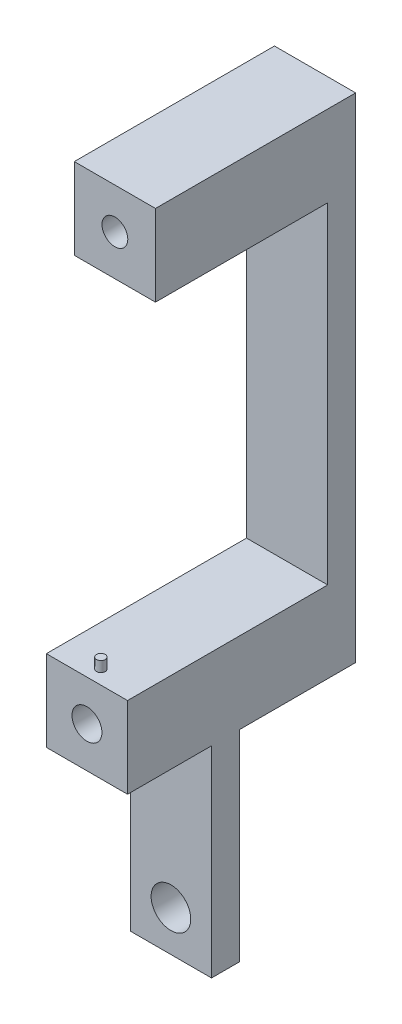
ISO-10303-21;
HEADER;
FILE_DESCRIPTION(('STEP AP214'),'2;1');
FILE_NAME('part.step','',(''),(''),'','','');
FILE_SCHEMA(('AUTOMOTIVE_DESIGN { 1 0 10303 214 1 1 1 1 }'));
ENDSEC;
DATA;
#1=APPLICATION_CONTEXT('core data for automotive mechanical design processes');
#2=APPLICATION_PROTOCOL_DEFINITION('international standard','automotive_design',2000,#1);
#3=PRODUCT_CONTEXT('',#1,'mechanical');
#4=PRODUCT('Part','Part','',(#3));
#5=PRODUCT_RELATED_PRODUCT_CATEGORY('part','',(#4));
#6=PRODUCT_DEFINITION_FORMATION('','',#4);
#7=PRODUCT_DEFINITION_CONTEXT('part definition',#1,'design');
#8=PRODUCT_DEFINITION('design','',#6,#7);
#9=PRODUCT_DEFINITION_SHAPE('','',#8);
#10=(LENGTH_UNIT() NAMED_UNIT(*) SI_UNIT(.MILLI.,.METRE.));
#11=(NAMED_UNIT(*) PLANE_ANGLE_UNIT() SI_UNIT($,.RADIAN.));
#12=(NAMED_UNIT(*) SI_UNIT($,.STERADIAN.) SOLID_ANGLE_UNIT());
#13=UNCERTAINTY_MEASURE_WITH_UNIT(LENGTH_MEASURE(1.E-05),#10,'distance_accuracy_value','');
#14=(GEOMETRIC_REPRESENTATION_CONTEXT(3) GLOBAL_UNCERTAINTY_ASSIGNED_CONTEXT((#13)) GLOBAL_UNIT_ASSIGNED_CONTEXT((#10,
#11,#12)) REPRESENTATION_CONTEXT('',''));
#15=CARTESIAN_POINT('',(0.,0.,0.));
#16=DIRECTION('',(0.,0.,1.));
#17=DIRECTION('',(1.,0.,0.));
#18=AXIS2_PLACEMENT_3D('',#15,#16,#17);
#19=CARTESIAN_POINT('',(13.843,118.4148,-15.0495));
#20=DIRECTION('',(0.,0.,-1.));
#21=DIRECTION('',(-1.,0.,0.));
#22=AXIS2_PLACEMENT_3D('',#19,#20,#21);
#23=PLANE('',#22);
#24=DIRECTION('',(1.,0.,0.));
#25=VECTOR('',#24,1.);
#26=CARTESIAN_POINT('',(0.,104.5718,-15.0495));
#27=LINE('',#26,#25);
#28=CARTESIAN_POINT('',(0.,104.5718,-15.0495));
#29=VERTEX_POINT('',#28);
#30=CARTESIAN_POINT('',(13.843,104.5718,-15.0495));
#31=VERTEX_POINT('',#30);
#32=EDGE_CURVE('E154',#29,#31,#27,.T.);
#33=ORIENTED_EDGE('',*,*,#32,.F.);
#34=DIRECTION('',(0.,-1.,0.));
#35=VECTOR('',#34,1.);
#36=CARTESIAN_POINT('',(0.,118.4148,-15.0495));
#37=LINE('',#36,#35);
#38=CARTESIAN_POINT('',(0.,48.133,-15.0495));
#39=VERTEX_POINT('',#38);
#40=EDGE_CURVE('E56',#29,#39,#37,.T.);
#41=ORIENTED_EDGE('',*,*,#40,.T.);
#42=DIRECTION('',(1.,0.,0.));
#43=VECTOR('',#42,1.);
#44=CARTESIAN_POINT('',(13.843,48.133,-15.0495));
#45=LINE('',#44,#43);
#46=CARTESIAN_POINT('',(13.843,48.133,-15.0495));
#47=VERTEX_POINT('',#46);
#48=EDGE_CURVE('E158',#39,#47,#45,.T.);
#49=ORIENTED_EDGE('',*,*,#48,.T.);
#50=DIRECTION('',(0.,-1.,0.));
#51=VECTOR('',#50,1.);
#52=CARTESIAN_POINT('',(13.843,118.4148,-15.0495));
#53=LINE('',#52,#51);
#54=EDGE_CURVE('E176',#31,#47,#53,.T.);
#55=ORIENTED_EDGE('',*,*,#54,.F.);
#56=EDGE_LOOP('',(#33,#41,#49,#55));
#57=FACE_BOUND('',#56,.T.);
#58=ADVANCED_FACE('F40',(#57),#23,.F.);
#59=CARTESIAN_POINT('',(0.,48.133,4.7625));
#60=DIRECTION('',(0.,-1.,0.));
#61=DIRECTION('',(0.,0.,-1.));
#62=AXIS2_PLACEMENT_3D('',#59,#60,#61);
#63=PLANE('',#62);
#64=CARTESIAN_POINT('',(6.9215,48.133,16.7005));
#65=DIRECTION('',(0.,-1.,0.));
#66=DIRECTION('',(0.,0.,-1.));
#67=AXIS2_PLACEMENT_3D('',#64,#65,#66);
#68=CIRCLE('',#67,0.7493);
#69=CARTESIAN_POINT('',(6.9215,48.133,15.9512));
#70=VERTEX_POINT('',#69);
#71=EDGE_CURVE('E12',#70,#70,#68,.F.);
#72=ORIENTED_EDGE('',*,*,#71,.F.);
#73=EDGE_LOOP('',(#72));
#74=FACE_BOUND('',#73,.T.);
#75=ORIENTED_EDGE('',*,*,#48,.F.);
#76=DIRECTION('',(0.,0.,-1.));
#77=VECTOR('',#76,1.);
#78=CARTESIAN_POINT('',(0.,48.133,4.7625));
#79=LINE('',#78,#77);
#80=CARTESIAN_POINT('',(0.,48.133,19.08175));
#81=VERTEX_POINT('',#80);
#82=EDGE_CURVE('E261',#81,#39,#79,.T.);
#83=ORIENTED_EDGE('',*,*,#82,.F.);
#84=DIRECTION('',(-1.,0.,0.));
#85=VECTOR('',#84,1.);
#86=CARTESIAN_POINT('',(0.,48.133,19.08175));
#87=LINE('',#86,#85);
#88=CARTESIAN_POINT('',(13.843,48.133,19.08175));
#89=VERTEX_POINT('',#88);
#90=EDGE_CURVE('E227',#89,#81,#87,.T.);
#91=ORIENTED_EDGE('',*,*,#90,.F.);
#92=DIRECTION('',(0.,0.,-1.));
#93=VECTOR('',#92,1.);
#94=CARTESIAN_POINT('',(13.843,48.133,4.7625));
#95=LINE('',#94,#93);
#96=EDGE_CURVE('E271',#89,#47,#95,.T.);
#97=ORIENTED_EDGE('',*,*,#96,.T.);
#98=EDGE_LOOP('',(#75,#83,#91,#97));
#99=FACE_BOUND('',#98,.T.);
#100=ADVANCED_FACE('F316',(#74,#99),#63,.F.);
#101=CARTESIAN_POINT('',(0.,0.,4.7625));
#102=DIRECTION('',(0.,0.,-1.));
#103=DIRECTION('',(-1.,0.,0.));
#104=AXIS2_PLACEMENT_3D('',#101,#102,#103);
#105=PLANE('',#104);
#106=CARTESIAN_POINT('',(6.9215,6.9215,4.7625));
#107=DIRECTION('',(0.,0.,-1.));
#108=DIRECTION('',(-1.,0.,0.));
#109=AXIS2_PLACEMENT_3D('',#106,#107,#108);
#110=CIRCLE('',#109,3.3782);
#111=CARTESIAN_POINT('',(3.5433,6.9215,4.7625));
#112=VERTEX_POINT('',#111);
#113=EDGE_CURVE('E243',#112,#112,#110,.T.);
#114=ORIENTED_EDGE('',*,*,#113,.T.);
#115=EDGE_LOOP('',(#114));
#116=FACE_BOUND('',#115,.T.);
#117=DIRECTION('',(1.,0.,0.));
#118=VECTOR('',#117,1.);
#119=CARTESIAN_POINT('',(0.,34.29,4.7625));
#120=LINE('',#119,#118);
#121=CARTESIAN_POINT('',(0.,34.29,4.7625));
#122=VERTEX_POINT('',#121);
#123=CARTESIAN_POINT('',(13.843,34.29,4.7625));
#124=VERTEX_POINT('',#123);
#125=EDGE_CURVE('E215',#122,#124,#120,.T.);
#126=ORIENTED_EDGE('',*,*,#125,.F.);
#127=DIRECTION('',(0.,-1.,0.));
#128=VECTOR('',#127,1.);
#129=CARTESIAN_POINT('',(0.,0.,4.7625));
#130=LINE('',#129,#128);
#131=CARTESIAN_POINT('',(0.,0.,4.7625));
#132=VERTEX_POINT('',#131);
#133=EDGE_CURVE('E251',#122,#132,#130,.T.);
#134=ORIENTED_EDGE('',*,*,#133,.T.);
#135=DIRECTION('',(1.,0.,0.));
#136=VECTOR('',#135,1.);
#137=CARTESIAN_POINT('',(0.,0.,4.7625));
#138=LINE('',#137,#136);
#139=CARTESIAN_POINT('',(13.843,0.,4.7625));
#140=VERTEX_POINT('',#139);
#141=EDGE_CURVE('E254',#132,#140,#138,.T.);
#142=ORIENTED_EDGE('',*,*,#141,.T.);
#143=DIRECTION('',(0.,1.,0.));
#144=VECTOR('',#143,1.);
#145=CARTESIAN_POINT('',(13.843,0.,4.7625));
#146=LINE('',#145,#144);
#147=EDGE_CURVE('E258',#140,#124,#146,.T.);
#148=ORIENTED_EDGE('',*,*,#147,.T.);
#149=EDGE_LOOP('',(#126,#134,#142,#148));
#150=FACE_BOUND('',#149,.T.);
#151=ADVANCED_FACE('F329',(#116,#150),#105,.F.);
#152=CARTESIAN_POINT('',(0.,0.,4.7625));
#153=DIRECTION('',(1.,0.,0.));
#154=DIRECTION('',(0.,0.,-1.));
#155=AXIS2_PLACEMENT_3D('',#152,#153,#154);
#156=PLANE('',#155);
#157=ORIENTED_EDGE('',*,*,#82,.T.);
#158=ORIENTED_EDGE('',*,*,#40,.F.);
#159=DIRECTION('',(0.,0.,-1.));
#160=VECTOR('',#159,1.);
#161=CARTESIAN_POINT('',(0.,104.5718,14.31925));
#162=LINE('',#161,#160);
#163=CARTESIAN_POINT('',(0.,104.5718,14.31925));
#164=VERTEX_POINT('',#163);
#165=EDGE_CURVE('E136',#164,#29,#162,.T.);
#166=ORIENTED_EDGE('',*,*,#165,.F.);
#167=DIRECTION('',(0.,-1.,0.));
#168=VECTOR('',#167,1.);
#169=CARTESIAN_POINT('',(0.,118.4148,14.31925));
#170=LINE('',#169,#168);
#171=CARTESIAN_POINT('',(0.,118.4148,14.31925));
#172=VERTEX_POINT('',#171);
#173=EDGE_CURVE('E144',#172,#164,#170,.T.);
#174=ORIENTED_EDGE('',*,*,#173,.F.);
#175=DIRECTION('',(0.,0.,1.));
#176=VECTOR('',#175,1.);
#177=CARTESIAN_POINT('',(0.,118.4148,-19.812));
#178=LINE('',#177,#176);
#179=CARTESIAN_POINT('',(0.,118.4148,-19.812));
#180=VERTEX_POINT('',#179);
#181=EDGE_CURVE('E174',#180,#172,#178,.T.);
#182=ORIENTED_EDGE('',*,*,#181,.F.);
#183=DIRECTION('',(0.,1.,0.));
#184=VECTOR('',#183,1.);
#185=CARTESIAN_POINT('',(0.,48.133,-19.812));
#186=LINE('',#185,#184);
#187=CARTESIAN_POINT('',(0.,34.29,-19.812));
#188=VERTEX_POINT('',#187);
#189=EDGE_CURVE('E202',#188,#180,#186,.T.);
#190=ORIENTED_EDGE('',*,*,#189,.F.);
#191=DIRECTION('',(0.,0.,1.));
#192=VECTOR('',#191,1.);
#193=CARTESIAN_POINT('',(0.,34.29,-19.812));
#194=LINE('',#193,#192);
#195=CARTESIAN_POINT('',(0.,34.29,0.));
#196=VERTEX_POINT('',#195);
#197=EDGE_CURVE('E205',#188,#196,#194,.T.);
#198=ORIENTED_EDGE('',*,*,#197,.T.);
#199=DIRECTION('',(0.,-1.,0.));
#200=VECTOR('',#199,1.);
#201=CARTESIAN_POINT('',(0.,0.,0.));
#202=LINE('',#201,#200);
#203=CARTESIAN_POINT('',(0.,0.,0.));
#204=VERTEX_POINT('',#203);
#205=EDGE_CURVE('E247',#196,#204,#202,.T.);
#206=ORIENTED_EDGE('',*,*,#205,.T.);
#207=DIRECTION('',(0.,0.,-1.));
#208=VECTOR('',#207,1.);
#209=CARTESIAN_POINT('',(0.,0.,4.7625));
#210=LINE('',#209,#208);
#211=EDGE_CURVE('E49',#132,#204,#210,.T.);
#212=ORIENTED_EDGE('',*,*,#211,.F.);
#213=ORIENTED_EDGE('',*,*,#133,.F.);
#214=DIRECTION('',(0.,0.,-1.));
#215=VECTOR('',#214,1.);
#216=CARTESIAN_POINT('',(0.,34.29,19.08175));
#217=LINE('',#216,#215);
#218=CARTESIAN_POINT('',(0.,34.29,19.08175));
#219=VERTEX_POINT('',#218);
#220=EDGE_CURVE('E238',#219,#122,#217,.T.);
#221=ORIENTED_EDGE('',*,*,#220,.F.);
#222=DIRECTION('',(0.,-1.,0.));
#223=VECTOR('',#222,1.);
#224=CARTESIAN_POINT('',(0.,48.133,19.08175));
#225=LINE('',#224,#223);
#226=EDGE_CURVE('E216',#81,#219,#225,.T.);
#227=ORIENTED_EDGE('',*,*,#226,.F.);
#228=EDGE_LOOP('',(#157,#158,#166,#174,#182,#190,#198,#206,#212,#213,#221,#227));
#229=FACE_BOUND('',#228,.T.);
#230=ADVANCED_FACE('F42',(#229),#156,.F.);
#231=CARTESIAN_POINT('',(0.,0.,4.7625));
#232=DIRECTION('',(0.,1.,0.));
#233=DIRECTION('',(0.,0.,1.));
#234=AXIS2_PLACEMENT_3D('',#231,#232,#233);
#235=PLANE('',#234);
#236=DIRECTION('',(1.,0.,0.));
#237=VECTOR('',#236,1.);
#238=CARTESIAN_POINT('',(0.,0.,0.));
#239=LINE('',#238,#237);
#240=CARTESIAN_POINT('',(13.843,0.,0.));
#241=VERTEX_POINT('',#240);
#242=EDGE_CURVE('E264',#204,#241,#239,.T.);
#243=ORIENTED_EDGE('',*,*,#242,.T.);
#244=DIRECTION('',(0.,0.,-1.));
#245=VECTOR('',#244,1.);
#246=CARTESIAN_POINT('',(13.843,0.,4.7625));
#247=LINE('',#246,#245);
#248=EDGE_CURVE('E275',#140,#241,#247,.T.);
#249=ORIENTED_EDGE('',*,*,#248,.F.);
#250=ORIENTED_EDGE('',*,*,#141,.F.);
#251=ORIENTED_EDGE('',*,*,#211,.T.);
#252=EDGE_LOOP('',(#243,#249,#250,#251));
#253=FACE_BOUND('',#252,.T.);
#254=ADVANCED_FACE('F334',(#253),#235,.F.);
#255=CARTESIAN_POINT('',(13.843,0.,4.7625));
#256=DIRECTION('',(-1.,0.,0.));
#257=DIRECTION('',(0.,0.,1.));
#258=AXIS2_PLACEMENT_3D('',#255,#256,#257);
#259=PLANE('',#258);
#260=DIRECTION('',(0.,1.,0.));
#261=VECTOR('',#260,1.);
#262=CARTESIAN_POINT('',(13.843,0.,0.));
#263=LINE('',#262,#261);
#264=CARTESIAN_POINT('',(13.843,34.29,0.));
#265=VERTEX_POINT('',#264);
#266=EDGE_CURVE('E255',#241,#265,#263,.T.);
#267=ORIENTED_EDGE('',*,*,#266,.T.);
#268=DIRECTION('',(0.,0.,1.));
#269=VECTOR('',#268,1.);
#270=CARTESIAN_POINT('',(13.843,34.29,-19.812));
#271=LINE('',#270,#269);
#272=CARTESIAN_POINT('',(13.843,34.29,-19.812));
#273=VERTEX_POINT('',#272);
#274=EDGE_CURVE('E211',#273,#265,#271,.T.);
#275=ORIENTED_EDGE('',*,*,#274,.F.);
#276=DIRECTION('',(0.,-1.,0.));
#277=VECTOR('',#276,1.);
#278=CARTESIAN_POINT('',(13.843,48.133,-19.812));
#279=LINE('',#278,#277);
#280=CARTESIAN_POINT('',(13.843,118.4148,-19.812));
#281=VERTEX_POINT('',#280);
#282=EDGE_CURVE('E195',#281,#273,#279,.T.);
#283=ORIENTED_EDGE('',*,*,#282,.F.);
#284=DIRECTION('',(0.,0.,-1.));
#285=VECTOR('',#284,1.);
#286=CARTESIAN_POINT('',(13.843,118.4148,-19.812));
#287=LINE('',#286,#285);
#288=CARTESIAN_POINT('',(13.843,118.4148,14.31925));
#289=VERTEX_POINT('',#288);
#290=EDGE_CURVE('E162',#289,#281,#287,.T.);
#291=ORIENTED_EDGE('',*,*,#290,.F.);
#292=DIRECTION('',(0.,1.,0.));
#293=VECTOR('',#292,1.);
#294=CARTESIAN_POINT('',(13.843,118.4148,14.31925));
#295=LINE('',#294,#293);
#296=CARTESIAN_POINT('',(13.843,104.5718,14.31925));
#297=VERTEX_POINT('',#296);
#298=EDGE_CURVE('E143',#297,#289,#295,.T.);
#299=ORIENTED_EDGE('',*,*,#298,.F.);
#300=DIRECTION('',(0.,0.,-1.));
#301=VECTOR('',#300,1.);
#302=CARTESIAN_POINT('',(13.843,104.5718,14.31925));
#303=LINE('',#302,#301);
#304=EDGE_CURVE('E138',#297,#31,#303,.T.);
#305=ORIENTED_EDGE('',*,*,#304,.T.);
#306=ORIENTED_EDGE('',*,*,#54,.T.);
#307=ORIENTED_EDGE('',*,*,#96,.F.);
#308=DIRECTION('',(0.,1.,0.));
#309=VECTOR('',#308,1.);
#310=CARTESIAN_POINT('',(13.843,48.133,19.08175));
#311=LINE('',#310,#309);
#312=CARTESIAN_POINT('',(13.843,34.29,19.08175));
#313=VERTEX_POINT('',#312);
#314=EDGE_CURVE('E223',#313,#89,#311,.T.);
#315=ORIENTED_EDGE('',*,*,#314,.F.);
#316=DIRECTION('',(0.,0.,-1.));
#317=VECTOR('',#316,1.);
#318=CARTESIAN_POINT('',(13.843,34.29,19.08175));
#319=LINE('',#318,#317);
#320=EDGE_CURVE('E231',#313,#124,#319,.T.);
#321=ORIENTED_EDGE('',*,*,#320,.T.);
#322=ORIENTED_EDGE('',*,*,#147,.F.);
#323=ORIENTED_EDGE('',*,*,#248,.T.);
#324=EDGE_LOOP('',(#267,#275,#283,#291,#299,#305,#306,#307,#315,#321,#322,#323));
#325=FACE_BOUND('',#324,.T.);
#326=ADVANCED_FACE('F314',(#325),#259,.F.);
#327=CARTESIAN_POINT('',(0.,0.,0.));
#328=DIRECTION('',(0.,0.,-1.));
#329=DIRECTION('',(-1.,0.,0.));
#330=AXIS2_PLACEMENT_3D('',#327,#328,#329);
#331=PLANE('',#330);
#332=DIRECTION('',(-1.,0.,0.));
#333=VECTOR('',#332,1.);
#334=CARTESIAN_POINT('',(13.843,34.29,0.));
#335=LINE('',#334,#333);
#336=EDGE_CURVE('E64',#265,#196,#335,.T.);
#337=ORIENTED_EDGE('',*,*,#336,.F.);
#338=ORIENTED_EDGE('',*,*,#266,.F.);
#339=ORIENTED_EDGE('',*,*,#242,.F.);
#340=ORIENTED_EDGE('',*,*,#205,.F.);
#341=EDGE_LOOP('',(#337,#338,#339,#340));
#342=FACE_BOUND('',#341,.T.);
#343=CARTESIAN_POINT('',(6.9215,6.9215,0.));
#344=DIRECTION('',(0.,0.,-1.));
#345=DIRECTION('',(-1.,0.,0.));
#346=AXIS2_PLACEMENT_3D('',#343,#344,#345);
#347=CIRCLE('',#346,3.3782);
#348=CARTESIAN_POINT('',(3.5433,6.9215,0.));
#349=VERTEX_POINT('',#348);
#350=EDGE_CURVE('E242',#349,#349,#347,.T.);
#351=ORIENTED_EDGE('',*,*,#350,.F.);
#352=EDGE_LOOP('',(#351));
#353=FACE_BOUND('',#352,.T.);
#354=ADVANCED_FACE('F337',(#342,#353),#331,.T.);
#355=CARTESIAN_POINT('',(6.9215,6.9215,4.7625));
#356=DIRECTION('',(0.,0.,-1.));
#357=DIRECTION('',(-1.,0.,0.));
#358=AXIS2_PLACEMENT_3D('',#355,#356,#357);
#359=CYLINDRICAL_SURFACE('',#358,3.3782);
#360=ORIENTED_EDGE('',*,*,#113,.F.);
#361=EDGE_LOOP('',(#360));
#362=FACE_BOUND('',#361,.T.);
#363=ORIENTED_EDGE('',*,*,#350,.T.);
#364=EDGE_LOOP('',(#363));
#365=FACE_BOUND('',#364,.T.);
#366=ADVANCED_FACE('F384',(#362,#365),#359,.F.);
#367=CARTESIAN_POINT('',(0.,34.29,19.08175));
#368=DIRECTION('',(0.,1.,0.));
#369=DIRECTION('',(0.,0.,1.));
#370=AXIS2_PLACEMENT_3D('',#367,#368,#369);
#371=PLANE('',#370);
#372=ORIENTED_EDGE('',*,*,#125,.T.);
#373=ORIENTED_EDGE('',*,*,#320,.F.);
#374=DIRECTION('',(1.,0.,0.));
#375=VECTOR('',#374,1.);
#376=CARTESIAN_POINT('',(0.,34.29,19.08175));
#377=LINE('',#376,#375);
#378=EDGE_CURVE('E220',#219,#313,#377,.T.);
#379=ORIENTED_EDGE('',*,*,#378,.F.);
#380=ORIENTED_EDGE('',*,*,#220,.T.);
#381=EDGE_LOOP('',(#372,#373,#379,#380));
#382=FACE_BOUND('',#381,.T.);
#383=ADVANCED_FACE('F327',(#382),#371,.F.);
#384=CARTESIAN_POINT('',(0.,0.,19.08175));
#385=DIRECTION('',(0.,0.,1.));
#386=DIRECTION('',(1.,0.,0.));
#387=AXIS2_PLACEMENT_3D('',#384,#385,#386);
#388=PLANE('',#387);
#389=CARTESIAN_POINT('',(6.9215,41.2115,19.08175));
#390=DIRECTION('',(0.,0.,1.));
#391=DIRECTION('',(1.,0.,0.));
#392=AXIS2_PLACEMENT_3D('',#389,#390,#391);
#393=CIRCLE('',#392,2.5527);
#394=CARTESIAN_POINT('',(9.4742,41.2115,19.08175));
#395=VERTEX_POINT('',#394);
#396=EDGE_CURVE('E194',#395,#395,#393,.T.);
#397=ORIENTED_EDGE('',*,*,#396,.F.);
#398=EDGE_LOOP('',(#397));
#399=FACE_BOUND('',#398,.T.);
#400=ORIENTED_EDGE('',*,*,#226,.T.);
#401=ORIENTED_EDGE('',*,*,#378,.T.);
#402=ORIENTED_EDGE('',*,*,#314,.T.);
#403=ORIENTED_EDGE('',*,*,#90,.T.);
#404=EDGE_LOOP('',(#400,#401,#402,#403));
#405=FACE_BOUND('',#404,.T.);
#406=ADVANCED_FACE('F322',(#399,#405),#388,.T.);
#407=CARTESIAN_POINT('',(13.843,34.29,-19.812));
#408=DIRECTION('',(0.,1.,0.));
#409=DIRECTION('',(0.,0.,1.));
#410=AXIS2_PLACEMENT_3D('',#407,#408,#409);
#411=PLANE('',#410);
#412=ORIENTED_EDGE('',*,*,#336,.T.);
#413=ORIENTED_EDGE('',*,*,#197,.F.);
#414=DIRECTION('',(-1.,0.,0.));
#415=VECTOR('',#414,1.);
#416=CARTESIAN_POINT('',(13.843,34.29,-19.812));
#417=LINE('',#416,#415);
#418=EDGE_CURVE('E199',#273,#188,#417,.T.);
#419=ORIENTED_EDGE('',*,*,#418,.F.);
#420=ORIENTED_EDGE('',*,*,#274,.T.);
#421=EDGE_LOOP('',(#412,#413,#419,#420));
#422=FACE_BOUND('',#421,.T.);
#423=ADVANCED_FACE('F341',(#422),#411,.F.);
#424=CARTESIAN_POINT('',(0.,0.,-19.812));
#425=DIRECTION('',(0.,0.,-1.));
#426=DIRECTION('',(-1.,0.,0.));
#427=AXIS2_PLACEMENT_3D('',#424,#425,#426);
#428=PLANE('',#427);
#429=CARTESIAN_POINT('',(6.9215,111.4933,-19.812));
#430=DIRECTION('',(0.,0.,-1.));
#431=DIRECTION('',(-1.,0.,0.));
#432=AXIS2_PLACEMENT_3D('',#429,#430,#431);
#433=CIRCLE('',#432,4.12749999999999);
#434=CARTESIAN_POINT('',(2.79400000000001,111.4933,-19.812));
#435=VERTEX_POINT('',#434);
#436=EDGE_CURVE('E287',#435,#435,#433,.T.);
#437=ORIENTED_EDGE('',*,*,#436,.F.);
#438=EDGE_LOOP('',(#437));
#439=FACE_BOUND('',#438,.T.);
#440=CARTESIAN_POINT('',(6.9215,41.2115,-19.812));
#441=DIRECTION('',(0.,0.,-1.));
#442=DIRECTION('',(-1.,0.,0.));
#443=AXIS2_PLACEMENT_3D('',#440,#441,#442);
#444=CIRCLE('',#443,4.8641);
#445=CARTESIAN_POINT('',(2.0574,41.2115,-19.812));
#446=VERTEX_POINT('',#445);
#447=EDGE_CURVE('E182',#446,#446,#444,.T.);
#448=ORIENTED_EDGE('',*,*,#447,.F.);
#449=EDGE_LOOP('',(#448));
#450=FACE_BOUND('',#449,.T.);
#451=ORIENTED_EDGE('',*,*,#282,.T.);
#452=ORIENTED_EDGE('',*,*,#418,.T.);
#453=ORIENTED_EDGE('',*,*,#189,.T.);
#454=DIRECTION('',(-1.,0.,0.));
#455=VECTOR('',#454,1.);
#456=CARTESIAN_POINT('',(13.843,118.4148,-19.812));
#457=LINE('',#456,#455);
#458=EDGE_CURVE('E170',#281,#180,#457,.T.);
#459=ORIENTED_EDGE('',*,*,#458,.F.);
#460=EDGE_LOOP('',(#451,#452,#453,#459));
#461=FACE_BOUND('',#460,.T.);
#462=ADVANCED_FACE('F345',(#439,#450,#461),#428,.T.);
#463=CARTESIAN_POINT('',(6.9215,41.2115,27.01925));
#464=DIRECTION('',(0.,0.,-1.));
#465=DIRECTION('',(-1.,0.,0.));
#466=AXIS2_PLACEMENT_3D('',#463,#464,#465);
#467=CYLINDRICAL_SURFACE('',#466,2.5527);
#468=ORIENTED_EDGE('',*,*,#396,.T.);
#469=EDGE_LOOP('',(#468));
#470=FACE_BOUND('',#469,.T.);
#471=CARTESIAN_POINT('',(6.9215,41.2115,0.));
#472=DIRECTION('',(0.,0.,-1.));
#473=DIRECTION('',(-1.,0.,0.));
#474=AXIS2_PLACEMENT_3D('',#471,#472,#473);
#475=CIRCLE('',#474,2.5527);
#476=CARTESIAN_POINT('',(4.3688,41.2115,0.));
#477=VERTEX_POINT('',#476);
#478=EDGE_CURVE('E187',#477,#477,#475,.T.);
#479=ORIENTED_EDGE('',*,*,#478,.T.);
#480=EDGE_LOOP('',(#479));
#481=FACE_BOUND('',#480,.T.);
#482=ADVANCED_FACE('F369',(#470,#481),#467,.F.);
#483=CARTESIAN_POINT('',(6.9215,41.2115,0.));
#484=DIRECTION('',(0.,0.,-1.));
#485=DIRECTION('',(-1.,0.,0.));
#486=AXIS2_PLACEMENT_3D('',#483,#484,#485);
#487=CYLINDRICAL_SURFACE('',#486,4.8641);
#488=CARTESIAN_POINT('',(6.9215,41.2115,0.));
#489=DIRECTION('',(0.,0.,-1.));
#490=DIRECTION('',(-1.,0.,0.));
#491=AXIS2_PLACEMENT_3D('',#488,#489,#490);
#492=CIRCLE('',#491,4.8641);
#493=CARTESIAN_POINT('',(2.0574,41.2115,0.));
#494=VERTEX_POINT('',#493);
#495=EDGE_CURVE('E183',#494,#494,#492,.T.);
#496=ORIENTED_EDGE('',*,*,#495,.F.);
#497=EDGE_LOOP('',(#496));
#498=FACE_BOUND('',#497,.T.);
#499=ORIENTED_EDGE('',*,*,#447,.T.);
#500=EDGE_LOOP('',(#499));
#501=FACE_BOUND('',#500,.T.);
#502=ADVANCED_FACE('F356',(#498,#501),#487,.F.);
#503=CARTESIAN_POINT('',(6.9215,41.2115,0.));
#504=DIRECTION('',(0.,0.,-1.));
#505=DIRECTION('',(-1.,0.,0.));
#506=AXIS2_PLACEMENT_3D('',#503,#504,#505);
#507=PLANE('',#506);
#508=ORIENTED_EDGE('',*,*,#478,.F.);
#509=EDGE_LOOP('',(#508));
#510=FACE_BOUND('',#509,.T.);
#511=ORIENTED_EDGE('',*,*,#495,.T.);
#512=EDGE_LOOP('',(#511));
#513=FACE_BOUND('',#512,.T.);
#514=ADVANCED_FACE('F349',(#510,#513),#507,.T.);
#515=CARTESIAN_POINT('',(0.,118.4148,0.));
#516=DIRECTION('',(0.,-1.,0.));
#517=DIRECTION('',(0.,0.,-1.));
#518=AXIS2_PLACEMENT_3D('',#515,#516,#517);
#519=PLANE('',#518);
#520=ORIENTED_EDGE('',*,*,#290,.T.);
#521=ORIENTED_EDGE('',*,*,#458,.T.);
#522=ORIENTED_EDGE('',*,*,#181,.T.);
#523=DIRECTION('',(-1.,0.,0.));
#524=VECTOR('',#523,1.);
#525=CARTESIAN_POINT('',(0.,118.4148,14.31925));
#526=LINE('',#525,#524);
#527=EDGE_CURVE('E150',#289,#172,#526,.T.);
#528=ORIENTED_EDGE('',*,*,#527,.F.);
#529=EDGE_LOOP('',(#520,#521,#522,#528));
#530=FACE_BOUND('',#529,.T.);
#531=ADVANCED_FACE('F347',(#530),#519,.F.);
#532=CARTESIAN_POINT('',(0.,104.5718,14.31925));
#533=DIRECTION('',(0.,1.,0.));
#534=DIRECTION('',(0.,0.,1.));
#535=AXIS2_PLACEMENT_3D('',#532,#533,#534);
#536=PLANE('',#535);
#537=ORIENTED_EDGE('',*,*,#32,.T.);
#538=ORIENTED_EDGE('',*,*,#304,.F.);
#539=DIRECTION('',(1.,0.,0.));
#540=VECTOR('',#539,1.);
#541=CARTESIAN_POINT('',(0.,104.5718,14.31925));
#542=LINE('',#541,#540);
#543=EDGE_CURVE('E132',#164,#297,#542,.T.);
#544=ORIENTED_EDGE('',*,*,#543,.F.);
#545=ORIENTED_EDGE('',*,*,#165,.T.);
#546=EDGE_LOOP('',(#537,#538,#544,#545));
#547=FACE_BOUND('',#546,.T.);
#548=ADVANCED_FACE('F134',(#547),#536,.F.);
#549=CARTESIAN_POINT('',(0.,0.,14.31925));
#550=DIRECTION('',(0.,0.,1.));
#551=DIRECTION('',(1.,0.,0.));
#552=AXIS2_PLACEMENT_3D('',#549,#550,#551);
#553=PLANE('',#552);
#554=CARTESIAN_POINT('',(6.9215,111.4933,14.31925));
#555=DIRECTION('',(0.,0.,1.));
#556=DIRECTION('',(1.,0.,0.));
#557=AXIS2_PLACEMENT_3D('',#554,#555,#556);
#558=CIRCLE('',#557,2.2);
#559=CARTESIAN_POINT('',(9.1215,111.4933,14.31925));
#560=VERTEX_POINT('',#559);
#561=EDGE_CURVE('E284',#560,#560,#558,.T.);
#562=ORIENTED_EDGE('',*,*,#561,.F.);
#563=EDGE_LOOP('',(#562));
#564=FACE_BOUND('',#563,.T.);
#565=ORIENTED_EDGE('',*,*,#173,.T.);
#566=ORIENTED_EDGE('',*,*,#543,.T.);
#567=ORIENTED_EDGE('',*,*,#298,.T.);
#568=ORIENTED_EDGE('',*,*,#527,.T.);
#569=EDGE_LOOP('',(#565,#566,#567,#568));
#570=FACE_BOUND('',#569,.T.);
#571=ADVANCED_FACE('F148',(#564,#570),#553,.T.);
#572=CARTESIAN_POINT('',(6.9215,111.4933,-12.192));
#573=DIRECTION('',(0.,0.,-1.));
#574=DIRECTION('',(-1.,0.,0.));
#575=AXIS2_PLACEMENT_3D('',#572,#573,#574);
#576=CYLINDRICAL_SURFACE('',#575,4.12749999999999);
#577=CARTESIAN_POINT('',(6.9215,111.4933,-12.192));
#578=DIRECTION('',(0.,0.,-1.));
#579=DIRECTION('',(-1.,0.,0.));
#580=AXIS2_PLACEMENT_3D('',#577,#578,#579);
#581=CIRCLE('',#580,4.12749999999999);
#582=CARTESIAN_POINT('',(2.79400000000001,111.4933,-12.192));
#583=VERTEX_POINT('',#582);
#584=EDGE_CURVE('E294',#583,#583,#581,.T.);
#585=ORIENTED_EDGE('',*,*,#584,.F.);
#586=EDGE_LOOP('',(#585));
#587=FACE_BOUND('',#586,.T.);
#588=ORIENTED_EDGE('',*,*,#436,.T.);
#589=EDGE_LOOP('',(#588));
#590=FACE_BOUND('',#589,.T.);
#591=ADVANCED_FACE('F448',(#587,#590),#576,.F.);
#592=CARTESIAN_POINT('',(6.9215,111.4933,-12.192));
#593=DIRECTION('',(0.,0.,-1.));
#594=DIRECTION('',(-1.,0.,0.));
#595=AXIS2_PLACEMENT_3D('',#592,#593,#594);
#596=PLANE('',#595);
#597=CARTESIAN_POINT('',(6.9215,111.4933,-12.192));
#598=DIRECTION('',(0.,0.,-1.));
#599=DIRECTION('',(-1.,0.,0.));
#600=AXIS2_PLACEMENT_3D('',#597,#598,#599);
#601=CIRCLE('',#600,2.2);
#602=CARTESIAN_POINT('',(4.7215,111.4933,-12.192));
#603=VERTEX_POINT('',#602);
#604=EDGE_CURVE('E288',#603,#603,#601,.T.);
#605=ORIENTED_EDGE('',*,*,#604,.F.);
#606=EDGE_LOOP('',(#605));
#607=FACE_BOUND('',#606,.T.);
#608=ORIENTED_EDGE('',*,*,#584,.T.);
#609=EDGE_LOOP('',(#608));
#610=FACE_BOUND('',#609,.T.);
#611=ADVANCED_FACE('F445',(#607,#610),#596,.T.);
#612=CARTESIAN_POINT('',(6.9215,111.4933,19.08175));
#613=DIRECTION('',(0.,0.,-1.));
#614=DIRECTION('',(-1.,0.,0.));
#615=AXIS2_PLACEMENT_3D('',#612,#613,#614);
#616=CYLINDRICAL_SURFACE('',#615,2.2);
#617=ORIENTED_EDGE('',*,*,#561,.T.);
#618=EDGE_LOOP('',(#617));
#619=FACE_BOUND('',#618,.T.);
#620=ORIENTED_EDGE('',*,*,#604,.T.);
#621=EDGE_LOOP('',(#620));
#622=FACE_BOUND('',#621,.T.);
#623=ADVANCED_FACE('F419',(#619,#622),#616,.F.);
#624=CARTESIAN_POINT('',(6.9215,49.911,16.7005));
#625=DIRECTION('',(0.,-1.,0.));
#626=DIRECTION('',(0.,0.,-1.));
#627=AXIS2_PLACEMENT_3D('',#624,#625,#626);
#628=CYLINDRICAL_SURFACE('',#627,0.7493);
#629=CARTESIAN_POINT('',(6.9215,49.911,16.7005));
#630=DIRECTION('',(0.,1.,0.));
#631=DIRECTION('',(0.,0.,1.));
#632=AXIS2_PLACEMENT_3D('',#629,#630,#631);
#633=CIRCLE('',#632,0.7493);
#634=CARTESIAN_POINT('',(6.9215,49.911,17.4498));
#635=VERTEX_POINT('',#634);
#636=EDGE_CURVE('E297',#635,#635,#633,.T.);
#637=ORIENTED_EDGE('',*,*,#636,.F.);
#638=EDGE_LOOP('',(#637));
#639=FACE_BOUND('',#638,.T.);
#640=ORIENTED_EDGE('',*,*,#71,.T.);
#641=EDGE_LOOP('',(#640));
#642=FACE_BOUND('',#641,.T.);
#643=ADVANCED_FACE('F424',(#639,#642),#628,.T.);
#644=CARTESIAN_POINT('',(6.9215,49.911,16.7005));
#645=DIRECTION('',(0.,1.,0.));
#646=DIRECTION('',(0.,0.,1.));
#647=AXIS2_PLACEMENT_3D('',#644,#645,#646);
#648=PLANE('',#647);
#649=ORIENTED_EDGE('',*,*,#636,.T.);
#650=EDGE_LOOP('',(#649));
#651=FACE_BOUND('',#650,.T.);
#652=ADVANCED_FACE('F429',(#651),#648,.T.);
#653=CLOSED_SHELL('',(#58,#100,#151,#230,#254,#326,#354,#366,#383,#406,#423,#462,#482,#502,#514,
#531,#548,#571,#591,#611,#623,#643,#652));
#654=MANIFOLD_SOLID_BREP('B2',#653);
#655=ADVANCED_BREP_SHAPE_REPRESENTATION('',(#18,#654),#14);
#656=SHAPE_DEFINITION_REPRESENTATION(#9,#655);
ENDSEC;
END-ISO-10303-21;
